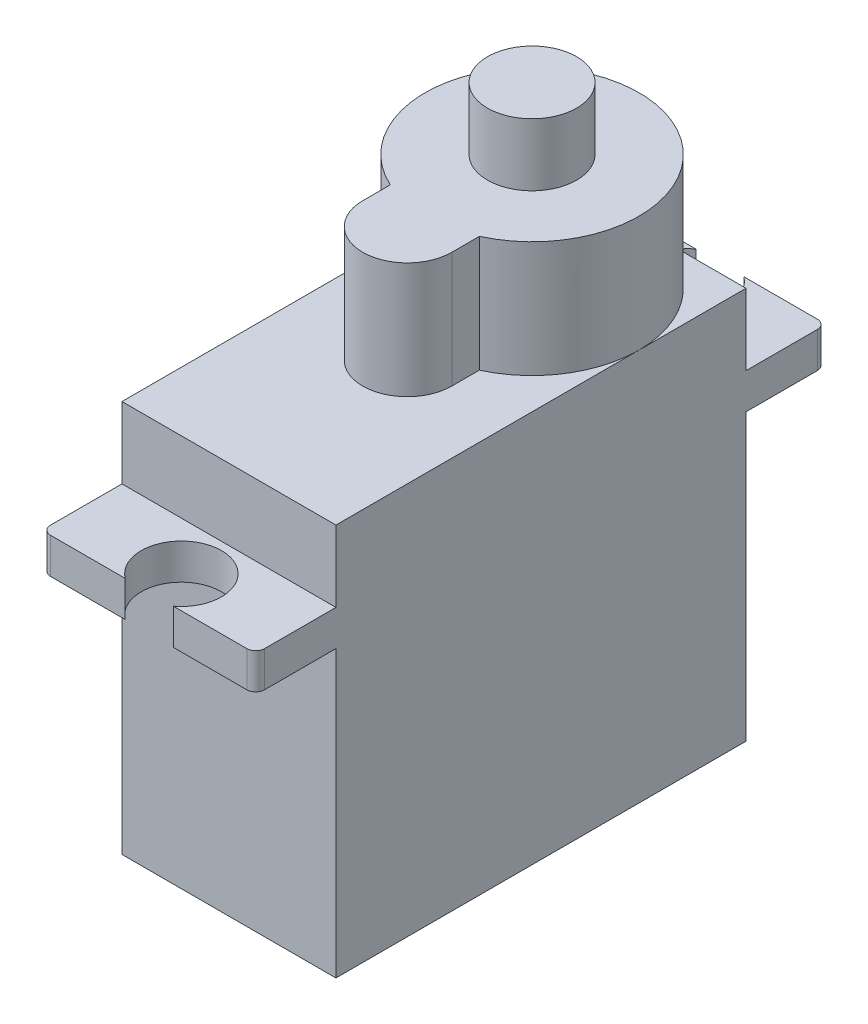
ISO-10303-21;
HEADER;
FILE_DESCRIPTION(('STEP AP214'),'2;1');
FILE_NAME('part.step','',(''),(''),'','','');
FILE_SCHEMA(('AUTOMOTIVE_DESIGN { 1 0 10303 214 1 1 1 1 }'));
ENDSEC;
DATA;
#1=APPLICATION_CONTEXT('core data for automotive mechanical design processes');
#2=APPLICATION_PROTOCOL_DEFINITION('international standard','automotive_design',2000,#1);
#3=PRODUCT_CONTEXT('',#1,'mechanical');
#4=PRODUCT('Part','Part','',(#3));
#5=PRODUCT_RELATED_PRODUCT_CATEGORY('part','',(#4));
#6=PRODUCT_DEFINITION_FORMATION('','',#4);
#7=PRODUCT_DEFINITION_CONTEXT('part definition',#1,'design');
#8=PRODUCT_DEFINITION('design','',#6,#7);
#9=PRODUCT_DEFINITION_SHAPE('','',#8);
#10=(LENGTH_UNIT() NAMED_UNIT(*) SI_UNIT(.MILLI.,.METRE.));
#11=(NAMED_UNIT(*) PLANE_ANGLE_UNIT() SI_UNIT($,.RADIAN.));
#12=(NAMED_UNIT(*) SI_UNIT($,.STERADIAN.) SOLID_ANGLE_UNIT());
#13=UNCERTAINTY_MEASURE_WITH_UNIT(LENGTH_MEASURE(1.E-05),#10,'distance_accuracy_value','');
#14=(GEOMETRIC_REPRESENTATION_CONTEXT(3) GLOBAL_UNCERTAINTY_ASSIGNED_CONTEXT((#13)) GLOBAL_UNIT_ASSIGNED_CONTEXT((#10,
#11,#12)) REPRESENTATION_CONTEXT('',''));
#15=CARTESIAN_POINT('',(0.,0.,0.));
#16=DIRECTION('',(0.,0.,1.));
#17=DIRECTION('',(1.,0.,0.));
#18=AXIS2_PLACEMENT_3D('',#15,#16,#17);
#19=CARTESIAN_POINT('',(45.3143674534142,22.,93.1515964372952));
#20=DIRECTION('',(0.,0.,1.));
#21=DIRECTION('',(1.,0.,0.));
#22=AXIS2_PLACEMENT_3D('',#19,#20,#21);
#23=PLANE('',#22);
#24=DIRECTION('',(1.,0.,0.));
#25=VECTOR('',#24,1.);
#26=CARTESIAN_POINT('',(45.3143674534142,18.,93.1515964372952));
#27=LINE('',#26,#25);
#28=CARTESIAN_POINT('',(45.3143674534142,18.,93.1515964372952));
#29=VERTEX_POINT('',#28);
#30=CARTESIAN_POINT('',(57.3143674534142,18.,93.1515964372952));
#31=VERTEX_POINT('',#30);
#32=EDGE_CURVE('E207',#29,#31,#27,.T.);
#33=ORIENTED_EDGE('',*,*,#32,.F.);
#34=DIRECTION('',(0.,-1.,0.));
#35=VECTOR('',#34,1.);
#36=CARTESIAN_POINT('',(45.3143674534142,22.,93.1515964372952));
#37=LINE('',#36,#35);
#38=CARTESIAN_POINT('',(45.3143674534142,22.,93.1515964372952));
#39=VERTEX_POINT('',#38);
#40=EDGE_CURVE('E222',#39,#29,#37,.T.);
#41=ORIENTED_EDGE('',*,*,#40,.F.);
#42=DIRECTION('',(-1.,0.,0.));
#43=VECTOR('',#42,1.);
#44=CARTESIAN_POINT('',(45.3143674534142,22.,93.1515964372952));
#45=LINE('',#44,#43);
#46=CARTESIAN_POINT('',(51.3143674534142,22.,93.1515964372952));
#47=VERTEX_POINT('',#46);
#48=EDGE_CURVE('E380',#47,#39,#45,.T.);
#49=ORIENTED_EDGE('',*,*,#48,.F.);
#50=CARTESIAN_POINT('',(57.3143674534142,22.,93.1515964372952));
#51=VERTEX_POINT('',#50);
#52=EDGE_CURVE('E237',#51,#47,#45,.T.);
#53=ORIENTED_EDGE('',*,*,#52,.F.);
#54=DIRECTION('',(0.,-1.,0.));
#55=VECTOR('',#54,1.);
#56=CARTESIAN_POINT('',(57.3143674534142,22.,93.1515964372952));
#57=LINE('',#56,#55);
#58=EDGE_CURVE('E226',#51,#31,#57,.T.);
#59=ORIENTED_EDGE('',*,*,#58,.T.);
#60=EDGE_LOOP('',(#33,#41,#49,#53,#59));
#61=FACE_BOUND('',#60,.T.);
#62=ADVANCED_FACE('F34',(#61),#23,.F.);
#63=CARTESIAN_POINT('',(45.3143674534142,22.,116.151596437295));
#64=DIRECTION('',(0.,0.,-1.));
#65=DIRECTION('',(-1.,0.,0.));
#66=AXIS2_PLACEMENT_3D('',#63,#64,#65);
#67=PLANE('',#66);
#68=DIRECTION('',(-1.,0.,0.));
#69=VECTOR('',#68,1.);
#70=CARTESIAN_POINT('',(45.3143674534142,18.,116.151596437295));
#71=LINE('',#70,#69);
#72=CARTESIAN_POINT('',(57.3143674534142,18.,116.151596437295));
#73=VERTEX_POINT('',#72);
#74=CARTESIAN_POINT('',(45.3143674534142,18.,116.151596437295));
#75=VERTEX_POINT('',#74);
#76=EDGE_CURVE('E357',#73,#75,#71,.T.);
#77=ORIENTED_EDGE('',*,*,#76,.F.);
#78=DIRECTION('',(0.,-1.,0.));
#79=VECTOR('',#78,1.);
#80=CARTESIAN_POINT('',(57.3143674534142,22.,116.151596437295));
#81=LINE('',#80,#79);
#82=CARTESIAN_POINT('',(57.3143674534142,22.,116.151596437295));
#83=VERTEX_POINT('',#82);
#84=EDGE_CURVE('E243',#83,#73,#81,.T.);
#85=ORIENTED_EDGE('',*,*,#84,.F.);
#86=DIRECTION('',(1.,0.,0.));
#87=VECTOR('',#86,1.);
#88=CARTESIAN_POINT('',(45.3143674534142,22.,116.151596437295));
#89=LINE('',#88,#87);
#90=CARTESIAN_POINT('',(45.3143674534142,22.,116.151596437295));
#91=VERTEX_POINT('',#90);
#92=EDGE_CURVE('E373',#91,#83,#89,.T.);
#93=ORIENTED_EDGE('',*,*,#92,.F.);
#94=DIRECTION('',(0.,-1.,0.));
#95=VECTOR('',#94,1.);
#96=CARTESIAN_POINT('',(45.3143674534142,22.,116.151596437295));
#97=LINE('',#96,#95);
#98=EDGE_CURVE('E247',#91,#75,#97,.T.);
#99=ORIENTED_EDGE('',*,*,#98,.T.);
#100=EDGE_LOOP('',(#77,#85,#93,#99));
#101=FACE_BOUND('',#100,.T.);
#102=ADVANCED_FACE('F403',(#101),#67,.F.);
#103=CARTESIAN_POINT('',(51.3143674534142,32.,99.1515964372952));
#104=DIRECTION('',(0.,-1.,0.));
#105=DIRECTION('',(0.,0.,-1.));
#106=AXIS2_PLACEMENT_3D('',#103,#104,#105);
#107=CYLINDRICAL_SURFACE('',#106,2.5);
#108=CARTESIAN_POINT('',(51.3143674534142,28.5,99.1515964372952));
#109=DIRECTION('',(0.,1.,0.));
#110=DIRECTION('',(0.,0.,1.));
#111=AXIS2_PLACEMENT_3D('',#108,#109,#110);
#112=CIRCLE('',#111,2.5);
#113=CARTESIAN_POINT('',(51.3143674534142,28.5,101.651596437295));
#114=VERTEX_POINT('',#113);
#115=EDGE_CURVE('E281',#114,#114,#112,.T.);
#116=ORIENTED_EDGE('',*,*,#115,.T.);
#117=EDGE_LOOP('',(#116));
#118=FACE_BOUND('',#117,.T.);
#119=CARTESIAN_POINT('',(51.3143674534142,32.,99.1515964372952));
#120=DIRECTION('',(0.,1.,0.));
#121=DIRECTION('',(0.,0.,1.));
#122=AXIS2_PLACEMENT_3D('',#119,#120,#121);
#123=CIRCLE('',#122,2.5);
#124=CARTESIAN_POINT('',(51.3143674534142,32.,101.651596437295));
#125=VERTEX_POINT('',#124);
#126=EDGE_CURVE('E282',#125,#125,#123,.T.);
#127=ORIENTED_EDGE('',*,*,#126,.F.);
#128=EDGE_LOOP('',(#127));
#129=FACE_BOUND('',#128,.T.);
#130=ADVANCED_FACE('F495',(#118,#129),#107,.T.);
#131=CARTESIAN_POINT('',(51.3143674534142,32.,99.1515964372952));
#132=DIRECTION('',(0.,1.,0.));
#133=DIRECTION('',(0.,0.,1.));
#134=AXIS2_PLACEMENT_3D('',#131,#132,#133);
#135=PLANE('',#134);
#136=ORIENTED_EDGE('',*,*,#126,.T.);
#137=EDGE_LOOP('',(#136));
#138=FACE_BOUND('',#137,.T.);
#139=ADVANCED_FACE('F499',(#138),#135,.T.);
#140=CARTESIAN_POINT('',(51.3143674534142,28.5,99.1515964372952));
#141=DIRECTION('',(0.,-1.,0.));
#142=DIRECTION('',(0.,0.,-1.));
#143=AXIS2_PLACEMENT_3D('',#140,#141,#142);
#144=CYLINDRICAL_SURFACE('',#143,6.);
#145=CARTESIAN_POINT('',(51.3143674534142,22.,99.1515964372952));
#146=DIRECTION('',(0.,1.,0.));
#147=DIRECTION('',(0.,0.,1.));
#148=AXIS2_PLACEMENT_3D('',#145,#146,#147);
#149=CIRCLE('',#148,6.);
#150=CARTESIAN_POINT('',(57.3143674534142,22.,99.1515964372952));
#151=VERTEX_POINT('',#150);
#152=EDGE_CURVE('E259',#151,#47,#149,.T.);
#153=ORIENTED_EDGE('',*,*,#152,.T.);
#154=CARTESIAN_POINT('',(45.3143674534142,22.,99.1515964372952));
#155=VERTEX_POINT('',#154);
#156=EDGE_CURVE('E433',#47,#155,#149,.T.);
#157=ORIENTED_EDGE('',*,*,#156,.T.);
#158=CARTESIAN_POINT('',(48.8143674534142,22.,104.605952494613));
#159=VERTEX_POINT('',#158);
#160=EDGE_CURVE('E258',#155,#159,#149,.T.);
#161=ORIENTED_EDGE('',*,*,#160,.T.);
#162=DIRECTION('',(0.,-1.,0.));
#163=VECTOR('',#162,1.);
#164=CARTESIAN_POINT('',(48.8143674534142,28.5,104.605952494613));
#165=LINE('',#164,#163);
#166=CARTESIAN_POINT('',(48.8143674534142,28.5,104.605952494613));
#167=VERTEX_POINT('',#166);
#168=EDGE_CURVE('E278',#167,#159,#165,.T.);
#169=ORIENTED_EDGE('',*,*,#168,.F.);
#170=CARTESIAN_POINT('',(51.3143674534142,28.5,99.1515964372952));
#171=DIRECTION('',(0.,1.,0.));
#172=DIRECTION('',(0.,0.,1.));
#173=AXIS2_PLACEMENT_3D('',#170,#171,#172);
#174=CIRCLE('',#173,6.);
#175=CARTESIAN_POINT('',(53.8143674534142,28.5,104.605952494613));
#176=VERTEX_POINT('',#175);
#177=EDGE_CURVE('E260',#176,#167,#174,.T.);
#178=ORIENTED_EDGE('',*,*,#177,.F.);
#179=DIRECTION('',(0.,-1.,0.));
#180=VECTOR('',#179,1.);
#181=CARTESIAN_POINT('',(53.8143674534142,28.5,104.605952494613));
#182=LINE('',#181,#180);
#183=CARTESIAN_POINT('',(53.8143674534142,22.,104.605952494613));
#184=VERTEX_POINT('',#183);
#185=EDGE_CURVE('E269',#176,#184,#182,.T.);
#186=ORIENTED_EDGE('',*,*,#185,.T.);
#187=EDGE_CURVE('E255',#184,#151,#149,.T.);
#188=ORIENTED_EDGE('',*,*,#187,.T.);
#189=EDGE_LOOP('',(#153,#157,#161,#169,#178,#186,#188));
#190=FACE_BOUND('',#189,.T.);
#191=ADVANCED_FACE('F418',(#190),#144,.T.);
#192=CARTESIAN_POINT('',(48.8143674534142,28.5,106.151596437295));
#193=DIRECTION('',(1.,0.,0.));
#194=DIRECTION('',(0.,0.,-1.));
#195=AXIS2_PLACEMENT_3D('',#192,#193,#194);
#196=PLANE('',#195);
#197=ORIENTED_EDGE('',*,*,#168,.T.);
#198=DIRECTION('',(0.,0.,1.));
#199=VECTOR('',#198,1.);
#200=CARTESIAN_POINT('',(48.8143674534142,22.,106.151596437295));
#201=LINE('',#200,#199);
#202=CARTESIAN_POINT('',(48.8143674534142,22.,106.151596437295));
#203=VERTEX_POINT('',#202);
#204=EDGE_CURVE('E252',#159,#203,#201,.T.);
#205=ORIENTED_EDGE('',*,*,#204,.T.);
#206=DIRECTION('',(0.,-1.,0.));
#207=VECTOR('',#206,1.);
#208=CARTESIAN_POINT('',(48.8143674534142,28.5,106.151596437295));
#209=LINE('',#208,#207);
#210=CARTESIAN_POINT('',(48.8143674534142,28.5,106.151596437295));
#211=VERTEX_POINT('',#210);
#212=EDGE_CURVE('E275',#211,#203,#209,.T.);
#213=ORIENTED_EDGE('',*,*,#212,.F.);
#214=DIRECTION('',(0.,0.,1.));
#215=VECTOR('',#214,1.);
#216=CARTESIAN_POINT('',(48.8143674534142,28.5,106.151596437295));
#217=LINE('',#216,#215);
#218=EDGE_CURVE('E263',#167,#211,#217,.T.);
#219=ORIENTED_EDGE('',*,*,#218,.F.);
#220=EDGE_LOOP('',(#197,#205,#213,#219));
#221=FACE_BOUND('',#220,.T.);
#222=ADVANCED_FACE('F432',(#221),#196,.F.);
#223=CARTESIAN_POINT('',(51.3143674534142,28.5,106.151596437295));
#224=DIRECTION('',(0.,-1.,0.));
#225=DIRECTION('',(0.,0.,-1.));
#226=AXIS2_PLACEMENT_3D('',#223,#224,#225);
#227=CYLINDRICAL_SURFACE('',#226,2.5);
#228=ORIENTED_EDGE('',*,*,#212,.T.);
#229=CARTESIAN_POINT('',(51.3143674534142,22.,106.151596437295));
#230=DIRECTION('',(0.,1.,0.));
#231=DIRECTION('',(0.,0.,1.));
#232=AXIS2_PLACEMENT_3D('',#229,#230,#231);
#233=CIRCLE('',#232,2.5);
#234=CARTESIAN_POINT('',(53.8143674534142,22.,106.151596437295));
#235=VERTEX_POINT('',#234);
#236=EDGE_CURVE('E249',#203,#235,#233,.T.);
#237=ORIENTED_EDGE('',*,*,#236,.T.);
#238=DIRECTION('',(0.,-1.,0.));
#239=VECTOR('',#238,1.);
#240=CARTESIAN_POINT('',(53.8143674534142,28.5,106.151596437295));
#241=LINE('',#240,#239);
#242=CARTESIAN_POINT('',(53.8143674534142,28.5,106.151596437295));
#243=VERTEX_POINT('',#242);
#244=EDGE_CURVE('E272',#243,#235,#241,.T.);
#245=ORIENTED_EDGE('',*,*,#244,.F.);
#246=CARTESIAN_POINT('',(51.3143674534142,28.5,106.151596437295));
#247=DIRECTION('',(0.,1.,0.));
#248=DIRECTION('',(0.,0.,1.));
#249=AXIS2_PLACEMENT_3D('',#246,#247,#248);
#250=CIRCLE('',#249,2.5);
#251=EDGE_CURVE('E265',#211,#243,#250,.T.);
#252=ORIENTED_EDGE('',*,*,#251,.F.);
#253=EDGE_LOOP('',(#228,#237,#245,#252));
#254=FACE_BOUND('',#253,.T.);
#255=ADVANCED_FACE('F428',(#254),#227,.T.);
#256=CARTESIAN_POINT('',(53.8143674534142,28.5,104.605952494613));
#257=DIRECTION('',(-1.,0.,0.));
#258=DIRECTION('',(0.,0.,1.));
#259=AXIS2_PLACEMENT_3D('',#256,#257,#258);
#260=PLANE('',#259);
#261=ORIENTED_EDGE('',*,*,#244,.T.);
#262=DIRECTION('',(0.,0.,-1.));
#263=VECTOR('',#262,1.);
#264=CARTESIAN_POINT('',(53.8143674534142,22.,104.605952494613));
#265=LINE('',#264,#263);
#266=EDGE_CURVE('E285',#235,#184,#265,.T.);
#267=ORIENTED_EDGE('',*,*,#266,.T.);
#268=ORIENTED_EDGE('',*,*,#185,.F.);
#269=DIRECTION('',(0.,0.,-1.));
#270=VECTOR('',#269,1.);
#271=CARTESIAN_POINT('',(53.8143674534142,28.5,104.605952494613));
#272=LINE('',#271,#270);
#273=EDGE_CURVE('E267',#243,#176,#272,.T.);
#274=ORIENTED_EDGE('',*,*,#273,.F.);
#275=EDGE_LOOP('',(#261,#267,#268,#274));
#276=FACE_BOUND('',#275,.T.);
#277=ADVANCED_FACE('F425',(#276),#260,.F.);
#278=CARTESIAN_POINT('',(51.3143674534142,28.5,99.1515964372952));
#279=DIRECTION('',(0.,1.,0.));
#280=DIRECTION('',(0.,0.,1.));
#281=AXIS2_PLACEMENT_3D('',#278,#279,#280);
#282=PLANE('',#281);
#283=ORIENTED_EDGE('',*,*,#115,.F.);
#284=EDGE_LOOP('',(#283));
#285=FACE_BOUND('',#284,.T.);
#286=ORIENTED_EDGE('',*,*,#177,.T.);
#287=ORIENTED_EDGE('',*,*,#218,.T.);
#288=ORIENTED_EDGE('',*,*,#251,.T.);
#289=ORIENTED_EDGE('',*,*,#273,.T.);
#290=EDGE_LOOP('',(#286,#287,#288,#289));
#291=FACE_BOUND('',#290,.T.);
#292=ADVANCED_FACE('F505',(#285,#291),#282,.T.);
#293=CARTESIAN_POINT('',(0.,22.,0.));
#294=DIRECTION('',(0.,1.,0.));
#295=DIRECTION('',(0.,0.,1.));
#296=AXIS2_PLACEMENT_3D('',#293,#294,#295);
#297=PLANE('',#296);
#298=ORIENTED_EDGE('',*,*,#152,.F.);
#299=DIRECTION('',(0.,0.,-1.));
#300=VECTOR('',#299,1.);
#301=CARTESIAN_POINT('',(57.3143674534142,22.,93.1515964372952));
#302=LINE('',#301,#300);
#303=EDGE_CURVE('E376',#151,#51,#302,.T.);
#304=ORIENTED_EDGE('',*,*,#303,.T.);
#305=ORIENTED_EDGE('',*,*,#52,.T.);
#306=EDGE_LOOP('',(#298,#304,#305));
#307=FACE_BOUND('',#306,.T.);
#308=ADVANCED_FACE('F437',(#307),#297,.T.);
#309=ORIENTED_EDGE('',*,*,#156,.F.);
#310=ORIENTED_EDGE('',*,*,#48,.T.);
#311=DIRECTION('',(0.,0.,1.));
#312=VECTOR('',#311,1.);
#313=CARTESIAN_POINT('',(45.3143674534142,22.,93.1515964372952));
#314=LINE('',#313,#312);
#315=EDGE_CURVE('E232',#39,#155,#314,.T.);
#316=ORIENTED_EDGE('',*,*,#315,.T.);
#317=EDGE_LOOP('',(#309,#310,#316));
#318=FACE_BOUND('',#317,.T.);
#319=ADVANCED_FACE('F435',(#318),#297,.T.);
#320=ORIENTED_EDGE('',*,*,#160,.F.);
#321=EDGE_CURVE('E374',#155,#91,#314,.T.);
#322=ORIENTED_EDGE('',*,*,#321,.T.);
#323=ORIENTED_EDGE('',*,*,#92,.T.);
#324=EDGE_CURVE('E377',#83,#151,#302,.T.);
#325=ORIENTED_EDGE('',*,*,#324,.T.);
#326=ORIENTED_EDGE('',*,*,#187,.F.);
#327=ORIENTED_EDGE('',*,*,#266,.F.);
#328=ORIENTED_EDGE('',*,*,#236,.F.);
#329=ORIENTED_EDGE('',*,*,#204,.F.);
#330=EDGE_LOOP('',(#320,#322,#323,#325,#326,#327,#328,#329));
#331=FACE_BOUND('',#330,.T.);
#332=ADVANCED_FACE('F397',(#331),#297,.T.);
#333=CARTESIAN_POINT('',(45.3143674534142,22.,93.1515964372952));
#334=DIRECTION('',(1.,0.,0.));
#335=DIRECTION('',(0.,0.,-1.));
#336=AXIS2_PLACEMENT_3D('',#333,#334,#335);
#337=PLANE('',#336);
#338=DIRECTION('',(0.,0.,1.));
#339=VECTOR('',#338,1.);
#340=CARTESIAN_POINT('',(45.3143674534142,18.,93.1515964372952));
#341=LINE('',#340,#339);
#342=CARTESIAN_POINT('',(45.3143674534142,18.,89.1515964372951));
#343=VERTEX_POINT('',#342);
#344=EDGE_CURVE('E203',#343,#29,#341,.T.);
#345=ORIENTED_EDGE('',*,*,#344,.F.);
#346=DIRECTION('',(0.,-1.,0.));
#347=VECTOR('',#346,1.);
#348=CARTESIAN_POINT('',(45.3143674534142,22.,89.1515964372951));
#349=LINE('',#348,#347);
#350=CARTESIAN_POINT('',(45.3143674534142,16.,89.1515964372951));
#351=VERTEX_POINT('',#350);
#352=EDGE_CURVE('E307',#343,#351,#349,.T.);
#353=ORIENTED_EDGE('',*,*,#352,.T.);
#354=DIRECTION('',(0.,0.,1.));
#355=VECTOR('',#354,1.);
#356=CARTESIAN_POINT('',(45.3143674534142,16.,93.1515964372952));
#357=LINE('',#356,#355);
#358=CARTESIAN_POINT('',(45.3143674534142,16.,93.1515964372952));
#359=VERTEX_POINT('',#358);
#360=EDGE_CURVE('E448',#351,#359,#357,.T.);
#361=ORIENTED_EDGE('',*,*,#360,.T.);
#362=CARTESIAN_POINT('',(45.3143674534142,0.,93.1515964372952));
#363=VERTEX_POINT('',#362);
#364=EDGE_CURVE('E234',#359,#363,#37,.T.);
#365=ORIENTED_EDGE('',*,*,#364,.T.);
#366=DIRECTION('',(0.,0.,1.));
#367=VECTOR('',#366,1.);
#368=CARTESIAN_POINT('',(45.3143674534142,0.,93.1515964372952));
#369=LINE('',#368,#367);
#370=CARTESIAN_POINT('',(45.3143674534142,0.,116.151596437295));
#371=VERTEX_POINT('',#370);
#372=EDGE_CURVE('E371',#363,#371,#369,.T.);
#373=ORIENTED_EDGE('',*,*,#372,.T.);
#374=CARTESIAN_POINT('',(45.3143674534142,16.,116.151596437295));
#375=VERTEX_POINT('',#374);
#376=EDGE_CURVE('E246',#375,#371,#97,.T.);
#377=ORIENTED_EDGE('',*,*,#376,.F.);
#378=DIRECTION('',(0.,0.,1.));
#379=VECTOR('',#378,1.);
#380=CARTESIAN_POINT('',(45.3143674534142,16.,116.151596437295));
#381=LINE('',#380,#379);
#382=CARTESIAN_POINT('',(45.3143674534142,16.,120.151596437295));
#383=VERTEX_POINT('',#382);
#384=EDGE_CURVE('E344',#375,#383,#381,.T.);
#385=ORIENTED_EDGE('',*,*,#384,.T.);
#386=DIRECTION('',(0.,-1.,0.));
#387=VECTOR('',#386,1.);
#388=CARTESIAN_POINT('',(45.3143674534142,22.,120.151596437295));
#389=LINE('',#388,#387);
#390=CARTESIAN_POINT('',(45.3143674534142,18.,120.151596437295));
#391=VERTEX_POINT('',#390);
#392=EDGE_CURVE('E305',#383,#391,#389,.F.);
#393=ORIENTED_EDGE('',*,*,#392,.T.);
#394=DIRECTION('',(0.,0.,1.));
#395=VECTOR('',#394,1.);
#396=CARTESIAN_POINT('',(45.3143674534142,18.,116.151596437295));
#397=LINE('',#396,#395);
#398=EDGE_CURVE('E327',#75,#391,#397,.T.);
#399=ORIENTED_EDGE('',*,*,#398,.F.);
#400=ORIENTED_EDGE('',*,*,#98,.F.);
#401=ORIENTED_EDGE('',*,*,#321,.F.);
#402=ORIENTED_EDGE('',*,*,#315,.F.);
#403=ORIENTED_EDGE('',*,*,#40,.T.);
#404=EDGE_LOOP('',(#345,#353,#361,#365,#373,#377,#385,#393,#399,#400,#401,#402,#403));
#405=FACE_BOUND('',#404,.T.);
#406=ADVANCED_FACE('F229',(#405),#337,.F.);
#407=CARTESIAN_POINT('',(57.3143674534142,22.,93.1515964372952));
#408=DIRECTION('',(-1.,0.,0.));
#409=DIRECTION('',(0.,0.,1.));
#410=AXIS2_PLACEMENT_3D('',#407,#408,#409);
#411=PLANE('',#410);
#412=DIRECTION('',(0.,0.,-1.));
#413=VECTOR('',#412,1.);
#414=CARTESIAN_POINT('',(57.3143674534142,16.,93.1515964372952));
#415=LINE('',#414,#413);
#416=CARTESIAN_POINT('',(57.3143674534142,16.,93.1515964372952));
#417=VERTEX_POINT('',#416);
#418=CARTESIAN_POINT('',(57.3143674534142,16.,89.1515964372951));
#419=VERTEX_POINT('',#418);
#420=EDGE_CURVE('E453',#417,#419,#415,.T.);
#421=ORIENTED_EDGE('',*,*,#420,.T.);
#422=DIRECTION('',(0.,-1.,0.));
#423=VECTOR('',#422,1.);
#424=CARTESIAN_POINT('',(57.3143674534142,22.,89.1515964372951));
#425=LINE('',#424,#423);
#426=CARTESIAN_POINT('',(57.3143674534142,18.,89.1515964372951));
#427=VERTEX_POINT('',#426);
#428=EDGE_CURVE('E300',#419,#427,#425,.F.);
#429=ORIENTED_EDGE('',*,*,#428,.T.);
#430=DIRECTION('',(0.,0.,-1.));
#431=VECTOR('',#430,1.);
#432=CARTESIAN_POINT('',(57.3143674534142,18.,93.1515964372952));
#433=LINE('',#432,#431);
#434=EDGE_CURVE('E227',#31,#427,#433,.T.);
#435=ORIENTED_EDGE('',*,*,#434,.F.);
#436=ORIENTED_EDGE('',*,*,#58,.F.);
#437=ORIENTED_EDGE('',*,*,#303,.F.);
#438=ORIENTED_EDGE('',*,*,#324,.F.);
#439=ORIENTED_EDGE('',*,*,#84,.T.);
#440=DIRECTION('',(0.,0.,-1.));
#441=VECTOR('',#440,1.);
#442=CARTESIAN_POINT('',(57.3143674534142,18.,116.151596437295));
#443=LINE('',#442,#441);
#444=CARTESIAN_POINT('',(57.3143674534142,18.,120.151596437295));
#445=VERTEX_POINT('',#444);
#446=EDGE_CURVE('E410',#445,#73,#443,.T.);
#447=ORIENTED_EDGE('',*,*,#446,.F.);
#448=DIRECTION('',(0.,-1.,0.));
#449=VECTOR('',#448,1.);
#450=CARTESIAN_POINT('',(57.3143674534142,22.,120.151596437295));
#451=LINE('',#450,#449);
#452=CARTESIAN_POINT('',(57.3143674534142,16.,120.151596437295));
#453=VERTEX_POINT('',#452);
#454=EDGE_CURVE('E297',#445,#453,#451,.T.);
#455=ORIENTED_EDGE('',*,*,#454,.T.);
#456=DIRECTION('',(0.,0.,-1.));
#457=VECTOR('',#456,1.);
#458=CARTESIAN_POINT('',(57.3143674534142,16.,116.151596437295));
#459=LINE('',#458,#457);
#460=CARTESIAN_POINT('',(57.3143674534142,16.,116.151596437295));
#461=VERTEX_POINT('',#460);
#462=EDGE_CURVE('E363',#453,#461,#459,.T.);
#463=ORIENTED_EDGE('',*,*,#462,.T.);
#464=CARTESIAN_POINT('',(57.3143674534142,0.,116.151596437295));
#465=VERTEX_POINT('',#464);
#466=EDGE_CURVE('E242',#461,#465,#81,.T.);
#467=ORIENTED_EDGE('',*,*,#466,.T.);
#468=DIRECTION('',(0.,0.,-1.));
#469=VECTOR('',#468,1.);
#470=CARTESIAN_POINT('',(57.3143674534142,0.,93.1515964372952));
#471=LINE('',#470,#469);
#472=CARTESIAN_POINT('',(57.3143674534142,0.,93.1515964372952));
#473=VERTEX_POINT('',#472);
#474=EDGE_CURVE('E386',#465,#473,#471,.T.);
#475=ORIENTED_EDGE('',*,*,#474,.T.);
#476=EDGE_CURVE('E233',#417,#473,#57,.T.);
#477=ORIENTED_EDGE('',*,*,#476,.F.);
#478=EDGE_LOOP('',(#421,#429,#435,#436,#437,#438,#439,#447,#455,#463,#467,#475,#477));
#479=FACE_BOUND('',#478,.T.);
#480=ADVANCED_FACE('F413',(#479),#411,.F.);
#481=ORIENTED_EDGE('',*,*,#364,.F.);
#482=DIRECTION('',(1.,0.,0.));
#483=VECTOR('',#482,1.);
#484=CARTESIAN_POINT('',(45.3143674534142,16.,93.1515964372952));
#485=LINE('',#484,#483);
#486=EDGE_CURVE('E450',#359,#417,#485,.T.);
#487=ORIENTED_EDGE('',*,*,#486,.T.);
#488=ORIENTED_EDGE('',*,*,#476,.T.);
#489=DIRECTION('',(-1.,0.,0.));
#490=VECTOR('',#489,1.);
#491=CARTESIAN_POINT('',(45.3143674534142,0.,93.1515964372952));
#492=LINE('',#491,#490);
#493=EDGE_CURVE('E239',#473,#363,#492,.T.);
#494=ORIENTED_EDGE('',*,*,#493,.T.);
#495=EDGE_LOOP('',(#481,#487,#488,#494));
#496=FACE_BOUND('',#495,.T.);
#497=ADVANCED_FACE('F478',(#496),#23,.F.);
#498=ORIENTED_EDGE('',*,*,#466,.F.);
#499=DIRECTION('',(-1.,0.,0.));
#500=VECTOR('',#499,1.);
#501=CARTESIAN_POINT('',(45.3143674534142,16.,116.151596437295));
#502=LINE('',#501,#500);
#503=EDGE_CURVE('E365',#461,#375,#502,.T.);
#504=ORIENTED_EDGE('',*,*,#503,.T.);
#505=ORIENTED_EDGE('',*,*,#376,.T.);
#506=DIRECTION('',(1.,0.,0.));
#507=VECTOR('',#506,1.);
#508=CARTESIAN_POINT('',(45.3143674534142,0.,116.151596437295));
#509=LINE('',#508,#507);
#510=EDGE_CURVE('E384',#371,#465,#509,.T.);
#511=ORIENTED_EDGE('',*,*,#510,.T.);
#512=EDGE_LOOP('',(#498,#504,#505,#511));
#513=FACE_BOUND('',#512,.T.);
#514=ADVANCED_FACE('F480',(#513),#67,.F.);
#515=CARTESIAN_POINT('',(51.3143674534142,0.,99.1515964372952));
#516=DIRECTION('',(0.,1.,0.));
#517=DIRECTION('',(0.,0.,1.));
#518=AXIS2_PLACEMENT_3D('',#515,#516,#517);
#519=PLANE('',#518);
#520=ORIENTED_EDGE('',*,*,#493,.F.);
#521=ORIENTED_EDGE('',*,*,#474,.F.);
#522=ORIENTED_EDGE('',*,*,#510,.F.);
#523=ORIENTED_EDGE('',*,*,#372,.F.);
#524=EDGE_LOOP('',(#520,#521,#522,#523));
#525=FACE_BOUND('',#524,.T.);
#526=ADVANCED_FACE('F486',(#525),#519,.F.);
#527=CARTESIAN_POINT('',(45.3143674534142,18.,120.651596437295));
#528=DIRECTION('',(0.,0.,-1.));
#529=DIRECTION('',(-1.,0.,0.));
#530=AXIS2_PLACEMENT_3D('',#527,#528,#529);
#531=PLANE('',#530);
#532=DIRECTION('',(1.,0.,0.));
#533=VECTOR('',#532,1.);
#534=CARTESIAN_POINT('',(45.3143674534142,18.,120.651596437295));
#535=LINE('',#534,#533);
#536=CARTESIAN_POINT('',(45.8143674534142,18.,120.651596437295));
#537=VERTEX_POINT('',#536);
#538=CARTESIAN_POINT('',(49.9944792425622,18.,120.651596437295));
#539=VERTEX_POINT('',#538);
#540=EDGE_CURVE('E323',#537,#539,#535,.T.);
#541=ORIENTED_EDGE('',*,*,#540,.F.);
#542=DIRECTION('',(0.,-1.,0.));
#543=VECTOR('',#542,1.);
#544=CARTESIAN_POINT('',(45.8143674534142,18.,120.651596437295));
#545=LINE('',#544,#543);
#546=CARTESIAN_POINT('',(45.8143674534142,16.,120.651596437295));
#547=VERTEX_POINT('',#546);
#548=EDGE_CURVE('E311',#537,#547,#545,.T.);
#549=ORIENTED_EDGE('',*,*,#548,.T.);
#550=DIRECTION('',(1.,0.,0.));
#551=VECTOR('',#550,1.);
#552=CARTESIAN_POINT('',(45.3143674534142,16.,120.651596437295));
#553=LINE('',#552,#551);
#554=CARTESIAN_POINT('',(49.9944792425622,16.,120.651596437295));
#555=VERTEX_POINT('',#554);
#556=EDGE_CURVE('E346',#547,#555,#553,.T.);
#557=ORIENTED_EDGE('',*,*,#556,.T.);
#558=DIRECTION('',(0.,-1.,0.));
#559=VECTOR('',#558,1.);
#560=CARTESIAN_POINT('',(49.9944792425622,18.,120.651596437295));
#561=LINE('',#560,#559);
#562=EDGE_CURVE('E335',#539,#555,#561,.T.);
#563=ORIENTED_EDGE('',*,*,#562,.F.);
#564=EDGE_LOOP('',(#541,#549,#557,#563));
#565=FACE_BOUND('',#564,.T.);
#566=ADVANCED_FACE('F332',(#565),#531,.F.);
#567=CARTESIAN_POINT('',(51.3444792425622,18.,118.851596437295));
#568=DIRECTION('',(0.,-1.,0.));
#569=DIRECTION('',(0.,0.,-1.));
#570=AXIS2_PLACEMENT_3D('',#567,#568,#569);
#571=CYLINDRICAL_SURFACE('',#570,2.25);
#572=CARTESIAN_POINT('',(51.3444792425622,16.,118.851596437295));
#573=DIRECTION('',(0.,-1.,0.));
#574=DIRECTION('',(0.,0.,1.));
#575=AXIS2_PLACEMENT_3D('',#572,#573,#574);
#576=CIRCLE('',#575,2.25);
#577=CARTESIAN_POINT('',(52.6944792425622,16.,120.651596437295));
#578=VERTEX_POINT('',#577);
#579=EDGE_CURVE('E351',#555,#578,#576,.T.);
#580=ORIENTED_EDGE('',*,*,#579,.T.);
#581=DIRECTION('',(0.,-1.,0.));
#582=VECTOR('',#581,1.);
#583=CARTESIAN_POINT('',(52.6944792425622,18.,120.651596437295));
#584=LINE('',#583,#582);
#585=CARTESIAN_POINT('',(52.6944792425622,18.,120.651596437295));
#586=VERTEX_POINT('',#585);
#587=EDGE_CURVE('E367',#586,#578,#584,.T.);
#588=ORIENTED_EDGE('',*,*,#587,.F.);
#589=CARTESIAN_POINT('',(51.3444792425622,18.,118.851596437295));
#590=DIRECTION('',(0.,-1.,0.));
#591=DIRECTION('',(0.,0.,1.));
#592=AXIS2_PLACEMENT_3D('',#589,#590,#591);
#593=CIRCLE('',#592,2.25);
#594=EDGE_CURVE('E337',#539,#586,#593,.T.);
#595=ORIENTED_EDGE('',*,*,#594,.F.);
#596=ORIENTED_EDGE('',*,*,#562,.T.);
#597=EDGE_LOOP('',(#580,#588,#595,#596));
#598=FACE_BOUND('',#597,.T.);
#599=ADVANCED_FACE('F539',(#598),#571,.F.);
#600=CARTESIAN_POINT('',(52.6944792425622,18.,120.651596437295));
#601=DIRECTION('',(0.,0.,-1.));
#602=DIRECTION('',(-1.,0.,0.));
#603=AXIS2_PLACEMENT_3D('',#600,#601,#602);
#604=PLANE('',#603);
#605=DIRECTION('',(1.,0.,0.));
#606=VECTOR('',#605,1.);
#607=CARTESIAN_POINT('',(52.6944792425622,16.,120.651596437295));
#608=LINE('',#607,#606);
#609=CARTESIAN_POINT('',(56.8143674534142,16.,120.651596437295));
#610=VERTEX_POINT('',#609);
#611=EDGE_CURVE('E361',#578,#610,#608,.T.);
#612=ORIENTED_EDGE('',*,*,#611,.T.);
#613=DIRECTION('',(0.,-1.,0.));
#614=VECTOR('',#613,1.);
#615=CARTESIAN_POINT('',(56.8143674534142,18.,120.651596437295));
#616=LINE('',#615,#614);
#617=CARTESIAN_POINT('',(56.8143674534142,18.,120.651596437295));
#618=VERTEX_POINT('',#617);
#619=EDGE_CURVE('E11',#610,#618,#616,.F.);
#620=ORIENTED_EDGE('',*,*,#619,.T.);
#621=DIRECTION('',(1.,0.,0.));
#622=VECTOR('',#621,1.);
#623=CARTESIAN_POINT('',(52.6944792425622,18.,120.651596437295));
#624=LINE('',#623,#622);
#625=EDGE_CURVE('E409',#586,#618,#624,.T.);
#626=ORIENTED_EDGE('',*,*,#625,.F.);
#627=ORIENTED_EDGE('',*,*,#587,.T.);
#628=EDGE_LOOP('',(#612,#620,#626,#627));
#629=FACE_BOUND('',#628,.T.);
#630=ADVANCED_FACE('F537',(#629),#604,.F.);
#631=CARTESIAN_POINT('',(51.3444792425622,18.,118.851596437295));
#632=DIRECTION('',(0.,1.,0.));
#633=DIRECTION('',(0.,0.,1.));
#634=AXIS2_PLACEMENT_3D('',#631,#632,#633);
#635=PLANE('',#634);
#636=ORIENTED_EDGE('',*,*,#398,.T.);
#637=CARTESIAN_POINT('',(45.8143674534142,18.,120.151596437295));
#638=DIRECTION('',(0.,1.,0.));
#639=DIRECTION('',(0.,0.,1.));
#640=AXIS2_PLACEMENT_3D('',#637,#638,#639);
#641=CIRCLE('',#640,0.5);
#642=EDGE_CURVE('E42',#391,#537,#641,.T.);
#643=ORIENTED_EDGE('',*,*,#642,.T.);
#644=ORIENTED_EDGE('',*,*,#540,.T.);
#645=ORIENTED_EDGE('',*,*,#594,.T.);
#646=ORIENTED_EDGE('',*,*,#625,.T.);
#647=CARTESIAN_POINT('',(56.8143674534142,18.,120.151596437295));
#648=DIRECTION('',(0.,1.,0.));
#649=DIRECTION('',(0.,0.,1.));
#650=AXIS2_PLACEMENT_3D('',#647,#648,#649);
#651=CIRCLE('',#650,0.5);
#652=EDGE_CURVE('E317',#618,#445,#651,.T.);
#653=ORIENTED_EDGE('',*,*,#652,.T.);
#654=ORIENTED_EDGE('',*,*,#446,.T.);
#655=ORIENTED_EDGE('',*,*,#76,.T.);
#656=EDGE_LOOP('',(#636,#643,#644,#645,#646,#653,#654,#655));
#657=FACE_BOUND('',#656,.T.);
#658=ADVANCED_FACE('F322',(#657),#635,.T.);
#659=CARTESIAN_POINT('',(51.3444792425622,16.,118.851596437295));
#660=DIRECTION('',(0.,1.,0.));
#661=DIRECTION('',(0.,0.,1.));
#662=AXIS2_PLACEMENT_3D('',#659,#660,#661);
#663=PLANE('',#662);
#664=ORIENTED_EDGE('',*,*,#556,.F.);
#665=CARTESIAN_POINT('',(45.8143674534142,16.,120.151596437295));
#666=DIRECTION('',(0.,1.,0.));
#667=DIRECTION('',(0.,0.,1.));
#668=AXIS2_PLACEMENT_3D('',#665,#666,#667);
#669=CIRCLE('',#668,0.5);
#670=EDGE_CURVE('E315',#547,#383,#669,.F.);
#671=ORIENTED_EDGE('',*,*,#670,.T.);
#672=ORIENTED_EDGE('',*,*,#384,.F.);
#673=ORIENTED_EDGE('',*,*,#503,.F.);
#674=ORIENTED_EDGE('',*,*,#462,.F.);
#675=CARTESIAN_POINT('',(56.8143674534142,16.,120.151596437295));
#676=DIRECTION('',(0.,1.,0.));
#677=DIRECTION('',(0.,0.,1.));
#678=AXIS2_PLACEMENT_3D('',#675,#676,#677);
#679=CIRCLE('',#678,0.5);
#680=EDGE_CURVE('E55',#453,#610,#679,.F.);
#681=ORIENTED_EDGE('',*,*,#680,.T.);
#682=ORIENTED_EDGE('',*,*,#611,.F.);
#683=ORIENTED_EDGE('',*,*,#579,.F.);
#684=EDGE_LOOP('',(#664,#671,#672,#673,#674,#681,#682,#683));
#685=FACE_BOUND('',#684,.T.);
#686=ADVANCED_FACE('F342',(#685),#663,.F.);
#687=CARTESIAN_POINT('',(52.6944792425622,18.,88.6515964372951));
#688=DIRECTION('',(0.,0.,1.));
#689=DIRECTION('',(1.,0.,0.));
#690=AXIS2_PLACEMENT_3D('',#687,#688,#689);
#691=PLANE('',#690);
#692=DIRECTION('',(-1.,0.,0.));
#693=VECTOR('',#692,1.);
#694=CARTESIAN_POINT('',(52.6944792425622,18.,88.6515964372951));
#695=LINE('',#694,#693);
#696=CARTESIAN_POINT('',(56.8143674534142,18.,88.6515964372951));
#697=VERTEX_POINT('',#696);
#698=CARTESIAN_POINT('',(52.6944792425622,18.,88.6515964372951));
#699=VERTEX_POINT('',#698);
#700=EDGE_CURVE('E440',#697,#699,#695,.T.);
#701=ORIENTED_EDGE('',*,*,#700,.F.);
#702=DIRECTION('',(0.,-1.,0.));
#703=VECTOR('',#702,1.);
#704=CARTESIAN_POINT('',(56.8143674534142,18.,88.6515964372951));
#705=LINE('',#704,#703);
#706=CARTESIAN_POINT('',(56.8143674534142,16.,88.6515964372951));
#707=VERTEX_POINT('',#706);
#708=EDGE_CURVE('E290',#697,#707,#705,.T.);
#709=ORIENTED_EDGE('',*,*,#708,.T.);
#710=DIRECTION('',(-1.,0.,0.));
#711=VECTOR('',#710,1.);
#712=CARTESIAN_POINT('',(52.6944792425622,16.,88.6515964372951));
#713=LINE('',#712,#711);
#714=CARTESIAN_POINT('',(52.6944792425622,16.,88.6515964372951));
#715=VERTEX_POINT('',#714);
#716=EDGE_CURVE('E455',#707,#715,#713,.T.);
#717=ORIENTED_EDGE('',*,*,#716,.T.);
#718=DIRECTION('',(0.,-1.,0.));
#719=VECTOR('',#718,1.);
#720=CARTESIAN_POINT('',(52.6944792425622,18.,88.6515964372951));
#721=LINE('',#720,#719);
#722=EDGE_CURVE('E349',#699,#715,#721,.T.);
#723=ORIENTED_EDGE('',*,*,#722,.F.);
#724=EDGE_LOOP('',(#701,#709,#717,#723));
#725=FACE_BOUND('',#724,.T.);
#726=ADVANCED_FACE('F599',(#725),#691,.F.);
#727=CARTESIAN_POINT('',(51.3444792425622,18.,90.4515964372951));
#728=DIRECTION('',(0.,-1.,0.));
#729=DIRECTION('',(0.,0.,-1.));
#730=AXIS2_PLACEMENT_3D('',#727,#728,#729);
#731=CYLINDRICAL_SURFACE('',#730,2.25);
#732=CARTESIAN_POINT('',(51.3444792425622,16.,90.4515964372951));
#733=DIRECTION('',(0.,-1.,0.));
#734=DIRECTION('',(0.,0.,-1.));
#735=AXIS2_PLACEMENT_3D('',#732,#733,#734);
#736=CIRCLE('',#735,2.25);
#737=CARTESIAN_POINT('',(49.9944792425622,16.,88.6515964372951));
#738=VERTEX_POINT('',#737);
#739=EDGE_CURVE('E457',#715,#738,#736,.T.);
#740=ORIENTED_EDGE('',*,*,#739,.T.);
#741=DIRECTION('',(0.,-1.,0.));
#742=VECTOR('',#741,1.);
#743=CARTESIAN_POINT('',(49.9944792425622,18.,88.6515964372951));
#744=LINE('',#743,#742);
#745=CARTESIAN_POINT('',(49.9944792425622,18.,88.6515964372951));
#746=VERTEX_POINT('',#745);
#747=EDGE_CURVE('E354',#746,#738,#744,.T.);
#748=ORIENTED_EDGE('',*,*,#747,.F.);
#749=CARTESIAN_POINT('',(51.3444792425622,18.,90.4515964372951));
#750=DIRECTION('',(0.,-1.,0.));
#751=DIRECTION('',(0.,0.,-1.));
#752=AXIS2_PLACEMENT_3D('',#749,#750,#751);
#753=CIRCLE('',#752,2.25);
#754=EDGE_CURVE('E442',#699,#746,#753,.T.);
#755=ORIENTED_EDGE('',*,*,#754,.F.);
#756=ORIENTED_EDGE('',*,*,#722,.T.);
#757=EDGE_LOOP('',(#740,#748,#755,#756));
#758=FACE_BOUND('',#757,.T.);
#759=ADVANCED_FACE('F607',(#758),#731,.F.);
#760=CARTESIAN_POINT('',(45.3143674534142,18.,88.6515964372951));
#761=DIRECTION('',(0.,0.,1.));
#762=DIRECTION('',(1.,0.,0.));
#763=AXIS2_PLACEMENT_3D('',#760,#761,#762);
#764=PLANE('',#763);
#765=DIRECTION('',(-1.,0.,0.));
#766=VECTOR('',#765,1.);
#767=CARTESIAN_POINT('',(45.3143674534142,16.,88.6515964372951));
#768=LINE('',#767,#766);
#769=CARTESIAN_POINT('',(45.8143674534142,16.,88.6515964372951));
#770=VERTEX_POINT('',#769);
#771=EDGE_CURVE('E216',#738,#770,#768,.T.);
#772=ORIENTED_EDGE('',*,*,#771,.T.);
#773=DIRECTION('',(0.,-1.,0.));
#774=VECTOR('',#773,1.);
#775=CARTESIAN_POINT('',(45.8143674534142,18.,88.6515964372951));
#776=LINE('',#775,#774);
#777=CARTESIAN_POINT('',(45.8143674534142,18.,88.6515964372951));
#778=VERTEX_POINT('',#777);
#779=EDGE_CURVE('E309',#770,#778,#776,.F.);
#780=ORIENTED_EDGE('',*,*,#779,.T.);
#781=DIRECTION('',(-1.,0.,0.));
#782=VECTOR('',#781,1.);
#783=CARTESIAN_POINT('',(45.3143674534142,18.,88.6515964372951));
#784=LINE('',#783,#782);
#785=EDGE_CURVE('E446',#746,#778,#784,.T.);
#786=ORIENTED_EDGE('',*,*,#785,.F.);
#787=ORIENTED_EDGE('',*,*,#747,.T.);
#788=EDGE_LOOP('',(#772,#780,#786,#787));
#789=FACE_BOUND('',#788,.T.);
#790=ADVANCED_FACE('F465',(#789),#764,.F.);
#791=CARTESIAN_POINT('',(51.3444792425622,18.,90.4515964372951));
#792=DIRECTION('',(0.,-1.,0.));
#793=DIRECTION('',(0.,0.,-1.));
#794=AXIS2_PLACEMENT_3D('',#791,#792,#793);
#795=PLANE('',#794);
#796=ORIENTED_EDGE('',*,*,#434,.T.);
#797=CARTESIAN_POINT('',(56.8143674534142,18.,89.1515964372951));
#798=DIRECTION('',(0.,-1.,0.));
#799=DIRECTION('',(0.,0.,-1.));
#800=AXIS2_PLACEMENT_3D('',#797,#798,#799);
#801=CIRCLE('',#800,0.5);
#802=EDGE_CURVE('E303',#427,#697,#801,.F.);
#803=ORIENTED_EDGE('',*,*,#802,.T.);
#804=ORIENTED_EDGE('',*,*,#700,.T.);
#805=ORIENTED_EDGE('',*,*,#754,.T.);
#806=ORIENTED_EDGE('',*,*,#785,.T.);
#807=CARTESIAN_POINT('',(45.8143674534142,18.,89.1515964372951));
#808=DIRECTION('',(0.,-1.,0.));
#809=DIRECTION('',(0.,0.,-1.));
#810=AXIS2_PLACEMENT_3D('',#807,#808,#809);
#811=CIRCLE('',#810,0.5);
#812=EDGE_CURVE('E211',#778,#343,#811,.F.);
#813=ORIENTED_EDGE('',*,*,#812,.T.);
#814=ORIENTED_EDGE('',*,*,#344,.T.);
#815=ORIENTED_EDGE('',*,*,#32,.T.);
#816=EDGE_LOOP('',(#796,#803,#804,#805,#806,#813,#814,#815));
#817=FACE_BOUND('',#816,.T.);
#818=ADVANCED_FACE('F206',(#817),#795,.F.);
#819=CARTESIAN_POINT('',(51.3444792425622,16.,90.4515964372951));
#820=DIRECTION('',(0.,-1.,0.));
#821=DIRECTION('',(0.,0.,-1.));
#822=AXIS2_PLACEMENT_3D('',#819,#820,#821);
#823=PLANE('',#822);
#824=ORIENTED_EDGE('',*,*,#716,.F.);
#825=CARTESIAN_POINT('',(56.8143674534142,16.,89.1515964372951));
#826=DIRECTION('',(0.,-1.,0.));
#827=DIRECTION('',(0.,0.,-1.));
#828=AXIS2_PLACEMENT_3D('',#825,#826,#827);
#829=CIRCLE('',#828,0.5);
#830=EDGE_CURVE('E295',#707,#419,#829,.T.);
#831=ORIENTED_EDGE('',*,*,#830,.T.);
#832=ORIENTED_EDGE('',*,*,#420,.F.);
#833=ORIENTED_EDGE('',*,*,#486,.F.);
#834=ORIENTED_EDGE('',*,*,#360,.F.);
#835=CARTESIAN_POINT('',(45.8143674534142,16.,89.1515964372951));
#836=DIRECTION('',(0.,-1.,0.));
#837=DIRECTION('',(0.,0.,-1.));
#838=AXIS2_PLACEMENT_3D('',#835,#836,#837);
#839=CIRCLE('',#838,0.5);
#840=EDGE_CURVE('E293',#351,#770,#839,.T.);
#841=ORIENTED_EDGE('',*,*,#840,.T.);
#842=ORIENTED_EDGE('',*,*,#771,.F.);
#843=ORIENTED_EDGE('',*,*,#739,.F.);
#844=EDGE_LOOP('',(#824,#831,#832,#833,#834,#841,#842,#843));
#845=FACE_BOUND('',#844,.T.);
#846=ADVANCED_FACE('F472',(#845),#823,.T.);
#847=CARTESIAN_POINT('',(56.8143674534142,18.,89.1515964372951));
#848=DIRECTION('',(0.,-1.,0.));
#849=DIRECTION('',(0.,0.,-1.));
#850=AXIS2_PLACEMENT_3D('',#847,#848,#849);
#851=CYLINDRICAL_SURFACE('',#850,0.5);
#852=ORIENTED_EDGE('',*,*,#802,.F.);
#853=ORIENTED_EDGE('',*,*,#428,.F.);
#854=ORIENTED_EDGE('',*,*,#830,.F.);
#855=ORIENTED_EDGE('',*,*,#708,.F.);
#856=EDGE_LOOP('',(#852,#853,#854,#855));
#857=FACE_BOUND('',#856,.T.);
#858=ADVANCED_FACE('F523',(#857),#851,.T.);
#859=CARTESIAN_POINT('',(45.8143674534142,22.,89.1515964372951));
#860=DIRECTION('',(0.,-1.,0.));
#861=DIRECTION('',(0.,0.,-1.));
#862=AXIS2_PLACEMENT_3D('',#859,#860,#861);
#863=CYLINDRICAL_SURFACE('',#862,0.5);
#864=ORIENTED_EDGE('',*,*,#812,.F.);
#865=ORIENTED_EDGE('',*,*,#779,.F.);
#866=ORIENTED_EDGE('',*,*,#840,.F.);
#867=ORIENTED_EDGE('',*,*,#352,.F.);
#868=EDGE_LOOP('',(#864,#865,#866,#867));
#869=FACE_BOUND('',#868,.T.);
#870=ADVANCED_FACE('F476',(#869),#863,.T.);
#871=CARTESIAN_POINT('',(45.8143674534142,18.,120.151596437295));
#872=DIRECTION('',(0.,-1.,0.));
#873=DIRECTION('',(0.,0.,-1.));
#874=AXIS2_PLACEMENT_3D('',#871,#872,#873);
#875=CYLINDRICAL_SURFACE('',#874,0.5);
#876=ORIENTED_EDGE('',*,*,#642,.F.);
#877=ORIENTED_EDGE('',*,*,#392,.F.);
#878=ORIENTED_EDGE('',*,*,#670,.F.);
#879=ORIENTED_EDGE('',*,*,#548,.F.);
#880=EDGE_LOOP('',(#876,#877,#878,#879));
#881=FACE_BOUND('',#880,.T.);
#882=ADVANCED_FACE('F339',(#881),#875,.T.);
#883=CARTESIAN_POINT('',(56.8143674534142,22.,120.151596437295));
#884=DIRECTION('',(0.,-1.,0.));
#885=DIRECTION('',(0.,0.,-1.));
#886=AXIS2_PLACEMENT_3D('',#883,#884,#885);
#887=CYLINDRICAL_SURFACE('',#886,0.5);
#888=ORIENTED_EDGE('',*,*,#652,.F.);
#889=ORIENTED_EDGE('',*,*,#619,.F.);
#890=ORIENTED_EDGE('',*,*,#680,.F.);
#891=ORIENTED_EDGE('',*,*,#454,.F.);
#892=EDGE_LOOP('',(#888,#889,#890,#891));
#893=FACE_BOUND('',#892,.T.);
#894=ADVANCED_FACE('F36',(#893),#887,.T.);
#895=CLOSED_SHELL('',(#62,#102,#130,#139,#191,#222,#255,#277,#292,#308,#319,#332,#406,#480,#497,
#514,#526,#566,#599,#630,#658,#686,#726,#759,#790,#818,#846,#858,#870,#882,#894));
#896=MANIFOLD_SOLID_BREP('B2',#895);
#897=ADVANCED_BREP_SHAPE_REPRESENTATION('',(#18,#896),#14);
#898=SHAPE_DEFINITION_REPRESENTATION(#9,#897);
ENDSEC;
END-ISO-10303-21;
